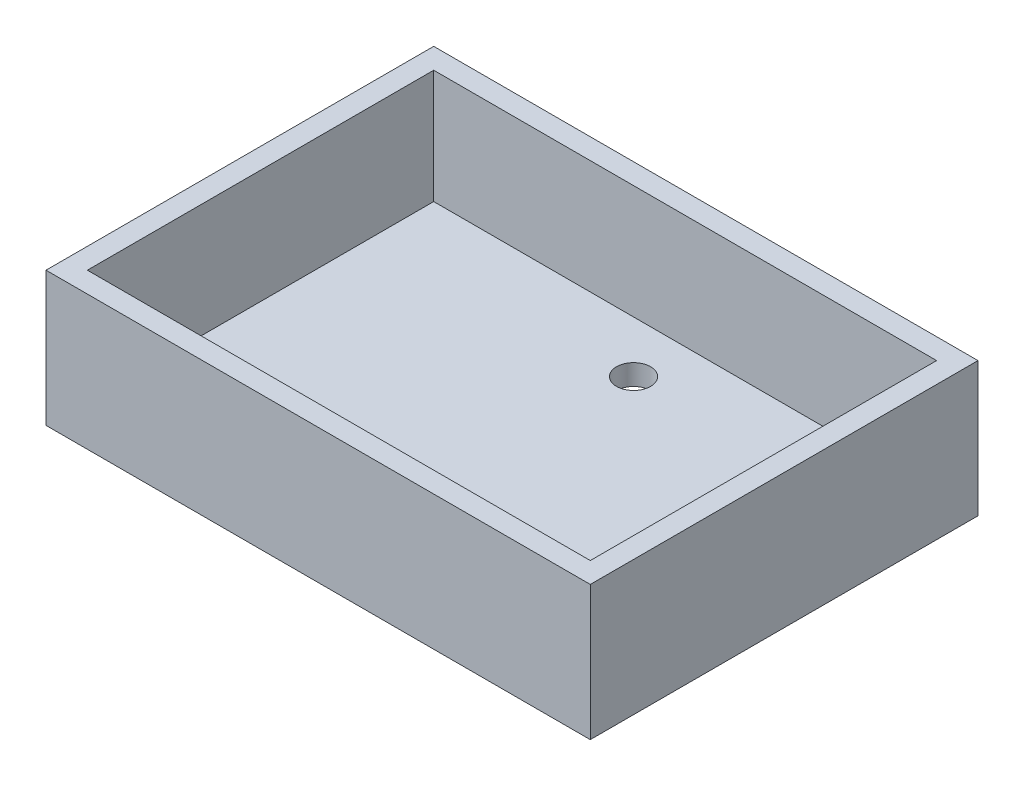
ISO-10303-21;
HEADER;
FILE_DESCRIPTION(('STEP AP214'),'2;1');
FILE_NAME('part.step','',(''),(''),'','','');
FILE_SCHEMA(('AUTOMOTIVE_DESIGN { 1 0 10303 214 1 1 1 1 }'));
ENDSEC;
DATA;
#1=APPLICATION_CONTEXT('core data for automotive mechanical design processes');
#2=APPLICATION_PROTOCOL_DEFINITION('international standard','automotive_design',2000,#1);
#3=PRODUCT_CONTEXT('',#1,'mechanical');
#4=PRODUCT('Part','Part','',(#3));
#5=PRODUCT_RELATED_PRODUCT_CATEGORY('part','',(#4));
#6=PRODUCT_DEFINITION_FORMATION('','',#4);
#7=PRODUCT_DEFINITION_CONTEXT('part definition',#1,'design');
#8=PRODUCT_DEFINITION('design','',#6,#7);
#9=PRODUCT_DEFINITION_SHAPE('','',#8);
#10=(LENGTH_UNIT() NAMED_UNIT(*) SI_UNIT(.MILLI.,.METRE.));
#11=(NAMED_UNIT(*) PLANE_ANGLE_UNIT() SI_UNIT($,.RADIAN.));
#12=(NAMED_UNIT(*) SI_UNIT($,.STERADIAN.) SOLID_ANGLE_UNIT());
#13=UNCERTAINTY_MEASURE_WITH_UNIT(LENGTH_MEASURE(1.E-05),#10,'distance_accuracy_value','');
#14=(GEOMETRIC_REPRESENTATION_CONTEXT(3) GLOBAL_UNCERTAINTY_ASSIGNED_CONTEXT((#13)) GLOBAL_UNIT_ASSIGNED_CONTEXT((#10,
#11,#12)) REPRESENTATION_CONTEXT('',''));
#15=CARTESIAN_POINT('',(0.,0.,0.));
#16=DIRECTION('',(0.,0.,1.));
#17=DIRECTION('',(1.,0.,0.));
#18=AXIS2_PLACEMENT_3D('',#15,#16,#17);
#19=CARTESIAN_POINT('',(0.,13.,-11.755));
#20=DIRECTION('',(0.,-1.,0.));
#21=DIRECTION('',(0.,0.,-1.));
#22=AXIS2_PLACEMENT_3D('',#19,#20,#21);
#23=CYLINDRICAL_SURFACE('',#22,1.65);
#24=CARTESIAN_POINT('',(0.,0.,-11.755));
#25=DIRECTION('',(0.,1.,0.));
#26=DIRECTION('',(0.,0.,1.));
#27=AXIS2_PLACEMENT_3D('',#24,#25,#26);
#28=CIRCLE('',#27,1.65);
#29=CARTESIAN_POINT('',(0.,0.,-10.105));
#30=VERTEX_POINT('',#29);
#31=EDGE_CURVE('E152',#30,#30,#28,.T.);
#32=ORIENTED_EDGE('',*,*,#31,.F.);
#33=EDGE_LOOP('',(#32));
#34=FACE_BOUND('',#33,.T.);
#35=CARTESIAN_POINT('',(0.,2.,-11.755));
#36=DIRECTION('',(0.,1.,0.));
#37=DIRECTION('',(0.,0.,1.));
#38=AXIS2_PLACEMENT_3D('',#35,#36,#37);
#39=CIRCLE('',#38,1.65);
#40=CARTESIAN_POINT('',(0.,2.,-10.105));
#41=VERTEX_POINT('',#40);
#42=EDGE_CURVE('E146',#41,#41,#39,.T.);
#43=ORIENTED_EDGE('',*,*,#42,.T.);
#44=EDGE_LOOP('',(#43));
#45=FACE_BOUND('',#44,.T.);
#46=ADVANCED_FACE('F33',(#34,#45),#23,.F.);
#47=CARTESIAN_POINT('',(0.,13.,11.745));
#48=DIRECTION('',(0.,-1.,0.));
#49=DIRECTION('',(0.,0.,-1.));
#50=AXIS2_PLACEMENT_3D('',#47,#48,#49);
#51=CYLINDRICAL_SURFACE('',#50,1.70773943651643);
#52=CARTESIAN_POINT('',(0.,0.,11.745));
#53=DIRECTION('',(0.,1.,0.));
#54=DIRECTION('',(0.,0.,1.));
#55=AXIS2_PLACEMENT_3D('',#52,#53,#54);
#56=CIRCLE('',#55,1.70773943651643);
#57=CARTESIAN_POINT('',(0.,0.,13.4527394365164));
#58=VERTEX_POINT('',#57);
#59=EDGE_CURVE('E149',#58,#58,#56,.T.);
#60=ORIENTED_EDGE('',*,*,#59,.F.);
#61=EDGE_LOOP('',(#60));
#62=FACE_BOUND('',#61,.T.);
#63=CARTESIAN_POINT('',(0.,2.,11.745));
#64=DIRECTION('',(0.,1.,0.));
#65=DIRECTION('',(0.,0.,1.));
#66=AXIS2_PLACEMENT_3D('',#63,#64,#65);
#67=CIRCLE('',#66,1.70773943651643);
#68=CARTESIAN_POINT('',(0.,2.,13.4527394365164));
#69=VERTEX_POINT('',#68);
#70=EDGE_CURVE('E37',#69,#69,#67,.T.);
#71=ORIENTED_EDGE('',*,*,#70,.T.);
#72=EDGE_LOOP('',(#71));
#73=FACE_BOUND('',#72,.T.);
#74=ADVANCED_FACE('F199',(#62,#73),#51,.F.);
#75=CARTESIAN_POINT('',(0.,13.,0.));
#76=DIRECTION('',(0.,1.,0.));
#77=DIRECTION('',(0.,0.,1.));
#78=AXIS2_PLACEMENT_3D('',#75,#76,#77);
#79=PLANE('',#78);
#80=DIRECTION('',(0.,0.,1.));
#81=VECTOR('',#80,1.);
#82=CARTESIAN_POINT('',(-24.315,13.,16.745));
#83=LINE('',#82,#81);
#84=CARTESIAN_POINT('',(-24.315,13.,-16.745));
#85=VERTEX_POINT('',#84);
#86=CARTESIAN_POINT('',(-24.315,13.,16.745));
#87=VERTEX_POINT('',#86);
#88=EDGE_CURVE('E49',#85,#87,#83,.T.);
#89=ORIENTED_EDGE('',*,*,#88,.F.);
#90=DIRECTION('',(-1.,0.,0.));
#91=VECTOR('',#90,1.);
#92=CARTESIAN_POINT('',(24.315,13.,-16.745));
#93=LINE('',#92,#91);
#94=CARTESIAN_POINT('',(24.315,13.,-16.745));
#95=VERTEX_POINT('',#94);
#96=EDGE_CURVE('E128',#95,#85,#93,.T.);
#97=ORIENTED_EDGE('',*,*,#96,.F.);
#98=DIRECTION('',(0.,0.,-1.));
#99=VECTOR('',#98,1.);
#100=CARTESIAN_POINT('',(24.315,13.,16.745));
#101=LINE('',#100,#99);
#102=CARTESIAN_POINT('',(24.315,13.,16.745));
#103=VERTEX_POINT('',#102);
#104=EDGE_CURVE('E131',#103,#95,#101,.T.);
#105=ORIENTED_EDGE('',*,*,#104,.F.);
#106=DIRECTION('',(1.,0.,0.));
#107=VECTOR('',#106,1.);
#108=CARTESIAN_POINT('',(24.315,13.,16.745));
#109=LINE('',#108,#107);
#110=EDGE_CURVE('E137',#87,#103,#109,.T.);
#111=ORIENTED_EDGE('',*,*,#110,.F.);
#112=EDGE_LOOP('',(#89,#97,#105,#111));
#113=FACE_BOUND('',#112,.T.);
#114=DIRECTION('',(0.,0.,1.));
#115=VECTOR('',#114,1.);
#116=CARTESIAN_POINT('',(-26.315,13.,18.745));
#117=LINE('',#116,#115);
#118=CARTESIAN_POINT('',(-26.315,13.,-18.745));
#119=VERTEX_POINT('',#118);
#120=CARTESIAN_POINT('',(-26.315,13.,18.745));
#121=VERTEX_POINT('',#120);
#122=EDGE_CURVE('E156',#119,#121,#117,.T.);
#123=ORIENTED_EDGE('',*,*,#122,.T.);
#124=DIRECTION('',(1.,0.,0.));
#125=VECTOR('',#124,1.);
#126=CARTESIAN_POINT('',(26.315,13.,18.745));
#127=LINE('',#126,#125);
#128=CARTESIAN_POINT('',(26.315,13.,18.745));
#129=VERTEX_POINT('',#128);
#130=EDGE_CURVE('E86',#121,#129,#127,.T.);
#131=ORIENTED_EDGE('',*,*,#130,.T.);
#132=DIRECTION('',(0.,0.,-1.));
#133=VECTOR('',#132,1.);
#134=CARTESIAN_POINT('',(26.315,13.,18.745));
#135=LINE('',#134,#133);
#136=CARTESIAN_POINT('',(26.315,13.,-18.745));
#137=VERTEX_POINT('',#136);
#138=EDGE_CURVE('E159',#129,#137,#135,.T.);
#139=ORIENTED_EDGE('',*,*,#138,.T.);
#140=DIRECTION('',(-1.,0.,0.));
#141=VECTOR('',#140,1.);
#142=CARTESIAN_POINT('',(26.315,13.,-18.745));
#143=LINE('',#142,#141);
#144=EDGE_CURVE('E58',#137,#119,#143,.T.);
#145=ORIENTED_EDGE('',*,*,#144,.T.);
#146=EDGE_LOOP('',(#123,#131,#139,#145));
#147=FACE_BOUND('',#146,.T.);
#148=ADVANCED_FACE('F205',(#113,#147),#79,.T.);
#149=CARTESIAN_POINT('',(0.,0.,0.));
#150=DIRECTION('',(0.,1.,0.));
#151=DIRECTION('',(0.,0.,1.));
#152=AXIS2_PLACEMENT_3D('',#149,#150,#151);
#153=PLANE('',#152);
#154=ORIENTED_EDGE('',*,*,#31,.T.);
#155=EDGE_LOOP('',(#154));
#156=FACE_BOUND('',#155,.T.);
#157=DIRECTION('',(0.,0.,1.));
#158=VECTOR('',#157,1.);
#159=CARTESIAN_POINT('',(-26.315,0.,18.745));
#160=LINE('',#159,#158);
#161=CARTESIAN_POINT('',(-26.315,0.,-18.745));
#162=VERTEX_POINT('',#161);
#163=CARTESIAN_POINT('',(-26.315,0.,18.745));
#164=VERTEX_POINT('',#163);
#165=EDGE_CURVE('E155',#162,#164,#160,.T.);
#166=ORIENTED_EDGE('',*,*,#165,.F.);
#167=DIRECTION('',(-1.,0.,0.));
#168=VECTOR('',#167,1.);
#169=CARTESIAN_POINT('',(26.315,0.,-18.745));
#170=LINE('',#169,#168);
#171=CARTESIAN_POINT('',(26.315,0.,-18.745));
#172=VERTEX_POINT('',#171);
#173=EDGE_CURVE('E79',#172,#162,#170,.T.);
#174=ORIENTED_EDGE('',*,*,#173,.F.);
#175=DIRECTION('',(0.,0.,-1.));
#176=VECTOR('',#175,1.);
#177=CARTESIAN_POINT('',(26.315,0.,18.745));
#178=LINE('',#177,#176);
#179=CARTESIAN_POINT('',(26.315,0.,18.745));
#180=VERTEX_POINT('',#179);
#181=EDGE_CURVE('E167',#180,#172,#178,.T.);
#182=ORIENTED_EDGE('',*,*,#181,.F.);
#183=DIRECTION('',(1.,0.,0.));
#184=VECTOR('',#183,1.);
#185=CARTESIAN_POINT('',(26.315,0.,18.745));
#186=LINE('',#185,#184);
#187=EDGE_CURVE('E165',#164,#180,#186,.T.);
#188=ORIENTED_EDGE('',*,*,#187,.F.);
#189=EDGE_LOOP('',(#166,#174,#182,#188));
#190=FACE_BOUND('',#189,.T.);
#191=ORIENTED_EDGE('',*,*,#59,.T.);
#192=EDGE_LOOP('',(#191));
#193=FACE_BOUND('',#192,.T.);
#194=ADVANCED_FACE('F181',(#156,#190,#193),#153,.F.);
#195=CARTESIAN_POINT('',(-26.315,13.,18.745));
#196=DIRECTION('',(1.,0.,0.));
#197=DIRECTION('',(0.,0.,-1.));
#198=AXIS2_PLACEMENT_3D('',#195,#196,#197);
#199=PLANE('',#198);
#200=ORIENTED_EDGE('',*,*,#165,.T.);
#201=DIRECTION('',(0.,-1.,0.));
#202=VECTOR('',#201,1.);
#203=CARTESIAN_POINT('',(-26.315,13.,18.745));
#204=LINE('',#203,#202);
#205=EDGE_CURVE('E11',#121,#164,#204,.T.);
#206=ORIENTED_EDGE('',*,*,#205,.F.);
#207=ORIENTED_EDGE('',*,*,#122,.F.);
#208=DIRECTION('',(0.,-1.,0.));
#209=VECTOR('',#208,1.);
#210=CARTESIAN_POINT('',(-26.315,13.,-18.745));
#211=LINE('',#210,#209);
#212=EDGE_CURVE('E162',#119,#162,#211,.T.);
#213=ORIENTED_EDGE('',*,*,#212,.T.);
#214=EDGE_LOOP('',(#200,#206,#207,#213));
#215=FACE_BOUND('',#214,.T.);
#216=ADVANCED_FACE('F35',(#215),#199,.F.);
#217=CARTESIAN_POINT('',(26.315,13.,18.745));
#218=DIRECTION('',(0.,0.,-1.));
#219=DIRECTION('',(-1.,0.,0.));
#220=AXIS2_PLACEMENT_3D('',#217,#218,#219);
#221=PLANE('',#220);
#222=ORIENTED_EDGE('',*,*,#187,.T.);
#223=DIRECTION('',(0.,-1.,0.));
#224=VECTOR('',#223,1.);
#225=CARTESIAN_POINT('',(26.315,13.,18.745));
#226=LINE('',#225,#224);
#227=EDGE_CURVE('E42',#129,#180,#226,.T.);
#228=ORIENTED_EDGE('',*,*,#227,.F.);
#229=ORIENTED_EDGE('',*,*,#130,.F.);
#230=ORIENTED_EDGE('',*,*,#205,.T.);
#231=EDGE_LOOP('',(#222,#228,#229,#230));
#232=FACE_BOUND('',#231,.T.);
#233=ADVANCED_FACE('F195',(#232),#221,.F.);
#234=CARTESIAN_POINT('',(26.315,13.,18.745));
#235=DIRECTION('',(-1.,0.,0.));
#236=DIRECTION('',(0.,0.,1.));
#237=AXIS2_PLACEMENT_3D('',#234,#235,#236);
#238=PLANE('',#237);
#239=ORIENTED_EDGE('',*,*,#181,.T.);
#240=DIRECTION('',(0.,-1.,0.));
#241=VECTOR('',#240,1.);
#242=CARTESIAN_POINT('',(26.315,13.,-18.745));
#243=LINE('',#242,#241);
#244=EDGE_CURVE('E171',#137,#172,#243,.T.);
#245=ORIENTED_EDGE('',*,*,#244,.F.);
#246=ORIENTED_EDGE('',*,*,#138,.F.);
#247=ORIENTED_EDGE('',*,*,#227,.T.);
#248=EDGE_LOOP('',(#239,#245,#246,#247));
#249=FACE_BOUND('',#248,.T.);
#250=ADVANCED_FACE('F177',(#249),#238,.F.);
#251=CARTESIAN_POINT('',(26.315,13.,-18.745));
#252=DIRECTION('',(0.,0.,1.));
#253=DIRECTION('',(1.,0.,0.));
#254=AXIS2_PLACEMENT_3D('',#251,#252,#253);
#255=PLANE('',#254);
#256=ORIENTED_EDGE('',*,*,#173,.T.);
#257=ORIENTED_EDGE('',*,*,#212,.F.);
#258=ORIENTED_EDGE('',*,*,#144,.F.);
#259=ORIENTED_EDGE('',*,*,#244,.T.);
#260=EDGE_LOOP('',(#256,#257,#258,#259));
#261=FACE_BOUND('',#260,.T.);
#262=ADVANCED_FACE('F186',(#261),#255,.F.);
#263=CARTESIAN_POINT('',(-24.315,2.,16.745));
#264=DIRECTION('',(-1.,0.,0.));
#265=DIRECTION('',(0.,0.,1.));
#266=AXIS2_PLACEMENT_3D('',#263,#264,#265);
#267=PLANE('',#266);
#268=ORIENTED_EDGE('',*,*,#88,.T.);
#269=DIRECTION('',(0.,1.,0.));
#270=VECTOR('',#269,1.);
#271=CARTESIAN_POINT('',(-24.315,2.,16.745));
#272=LINE('',#271,#270);
#273=CARTESIAN_POINT('',(-24.315,2.,16.745));
#274=VERTEX_POINT('',#273);
#275=EDGE_CURVE('E106',#274,#87,#272,.T.);
#276=ORIENTED_EDGE('',*,*,#275,.F.);
#277=DIRECTION('',(0.,0.,1.));
#278=VECTOR('',#277,1.);
#279=CARTESIAN_POINT('',(-24.315,2.,16.745));
#280=LINE('',#279,#278);
#281=CARTESIAN_POINT('',(-24.315,2.,-16.745));
#282=VERTEX_POINT('',#281);
#283=EDGE_CURVE('E110',#282,#274,#280,.T.);
#284=ORIENTED_EDGE('',*,*,#283,.F.);
#285=DIRECTION('',(0.,1.,0.));
#286=VECTOR('',#285,1.);
#287=CARTESIAN_POINT('',(-24.315,2.,-16.745));
#288=LINE('',#287,#286);
#289=EDGE_CURVE('E141',#282,#85,#288,.T.);
#290=ORIENTED_EDGE('',*,*,#289,.T.);
#291=EDGE_LOOP('',(#268,#276,#284,#290));
#292=FACE_BOUND('',#291,.T.);
#293=ADVANCED_FACE('F108',(#292),#267,.F.);
#294=CARTESIAN_POINT('',(24.315,2.,-16.745));
#295=DIRECTION('',(0.,0.,-1.));
#296=DIRECTION('',(-1.,0.,0.));
#297=AXIS2_PLACEMENT_3D('',#294,#295,#296);
#298=PLANE('',#297);
#299=ORIENTED_EDGE('',*,*,#96,.T.);
#300=ORIENTED_EDGE('',*,*,#289,.F.);
#301=DIRECTION('',(-1.,0.,0.));
#302=VECTOR('',#301,1.);
#303=CARTESIAN_POINT('',(24.315,2.,-16.745));
#304=LINE('',#303,#302);
#305=CARTESIAN_POINT('',(24.315,2.,-16.745));
#306=VERTEX_POINT('',#305);
#307=EDGE_CURVE('E116',#306,#282,#304,.T.);
#308=ORIENTED_EDGE('',*,*,#307,.F.);
#309=DIRECTION('',(0.,1.,0.));
#310=VECTOR('',#309,1.);
#311=CARTESIAN_POINT('',(24.315,2.,-16.745));
#312=LINE('',#311,#310);
#313=EDGE_CURVE('E143',#306,#95,#312,.T.);
#314=ORIENTED_EDGE('',*,*,#313,.T.);
#315=EDGE_LOOP('',(#299,#300,#308,#314));
#316=FACE_BOUND('',#315,.T.);
#317=ADVANCED_FACE('F193',(#316),#298,.F.);
#318=CARTESIAN_POINT('',(24.315,2.,16.745));
#319=DIRECTION('',(1.,0.,0.));
#320=DIRECTION('',(0.,0.,-1.));
#321=AXIS2_PLACEMENT_3D('',#318,#319,#320);
#322=PLANE('',#321);
#323=ORIENTED_EDGE('',*,*,#104,.T.);
#324=ORIENTED_EDGE('',*,*,#313,.F.);
#325=DIRECTION('',(0.,0.,-1.));
#326=VECTOR('',#325,1.);
#327=CARTESIAN_POINT('',(24.315,2.,16.745));
#328=LINE('',#327,#326);
#329=CARTESIAN_POINT('',(24.315,2.,16.745));
#330=VERTEX_POINT('',#329);
#331=EDGE_CURVE('E124',#330,#306,#328,.T.);
#332=ORIENTED_EDGE('',*,*,#331,.F.);
#333=DIRECTION('',(0.,1.,0.));
#334=VECTOR('',#333,1.);
#335=CARTESIAN_POINT('',(24.315,2.,16.745));
#336=LINE('',#335,#334);
#337=EDGE_CURVE('E115',#330,#103,#336,.T.);
#338=ORIENTED_EDGE('',*,*,#337,.T.);
#339=EDGE_LOOP('',(#323,#324,#332,#338));
#340=FACE_BOUND('',#339,.T.);
#341=ADVANCED_FACE('F263',(#340),#322,.F.);
#342=CARTESIAN_POINT('',(24.315,2.,16.745));
#343=DIRECTION('',(0.,0.,1.));
#344=DIRECTION('',(1.,0.,0.));
#345=AXIS2_PLACEMENT_3D('',#342,#343,#344);
#346=PLANE('',#345);
#347=ORIENTED_EDGE('',*,*,#110,.T.);
#348=ORIENTED_EDGE('',*,*,#337,.F.);
#349=DIRECTION('',(1.,0.,0.));
#350=VECTOR('',#349,1.);
#351=CARTESIAN_POINT('',(24.315,2.,16.745));
#352=LINE('',#351,#350);
#353=EDGE_CURVE('E119',#274,#330,#352,.T.);
#354=ORIENTED_EDGE('',*,*,#353,.F.);
#355=ORIENTED_EDGE('',*,*,#275,.T.);
#356=EDGE_LOOP('',(#347,#348,#354,#355));
#357=FACE_BOUND('',#356,.T.);
#358=ADVANCED_FACE('F120',(#357),#346,.F.);
#359=CARTESIAN_POINT('',(0.,2.,0.));
#360=DIRECTION('',(0.,1.,0.));
#361=DIRECTION('',(0.,0.,1.));
#362=AXIS2_PLACEMENT_3D('',#359,#360,#361);
#363=PLANE('',#362);
#364=ORIENTED_EDGE('',*,*,#42,.F.);
#365=EDGE_LOOP('',(#364));
#366=FACE_BOUND('',#365,.T.);
#367=ORIENTED_EDGE('',*,*,#70,.F.);
#368=EDGE_LOOP('',(#367));
#369=FACE_BOUND('',#368,.T.);
#370=ORIENTED_EDGE('',*,*,#283,.T.);
#371=ORIENTED_EDGE('',*,*,#353,.T.);
#372=ORIENTED_EDGE('',*,*,#331,.T.);
#373=ORIENTED_EDGE('',*,*,#307,.T.);
#374=EDGE_LOOP('',(#370,#371,#372,#373));
#375=FACE_BOUND('',#374,.T.);
#376=ADVANCED_FACE('F126',(#366,#369,#375),#363,.T.);
#377=CLOSED_SHELL('',(#46,#74,#148,#194,#216,#233,#250,#262,#293,#317,#341,#358,#376));
#378=MANIFOLD_SOLID_BREP('B2',#377);
#379=ADVANCED_BREP_SHAPE_REPRESENTATION('',(#18,#378),#14);
#380=SHAPE_DEFINITION_REPRESENTATION(#9,#379);
ENDSEC;
END-ISO-10303-21;
